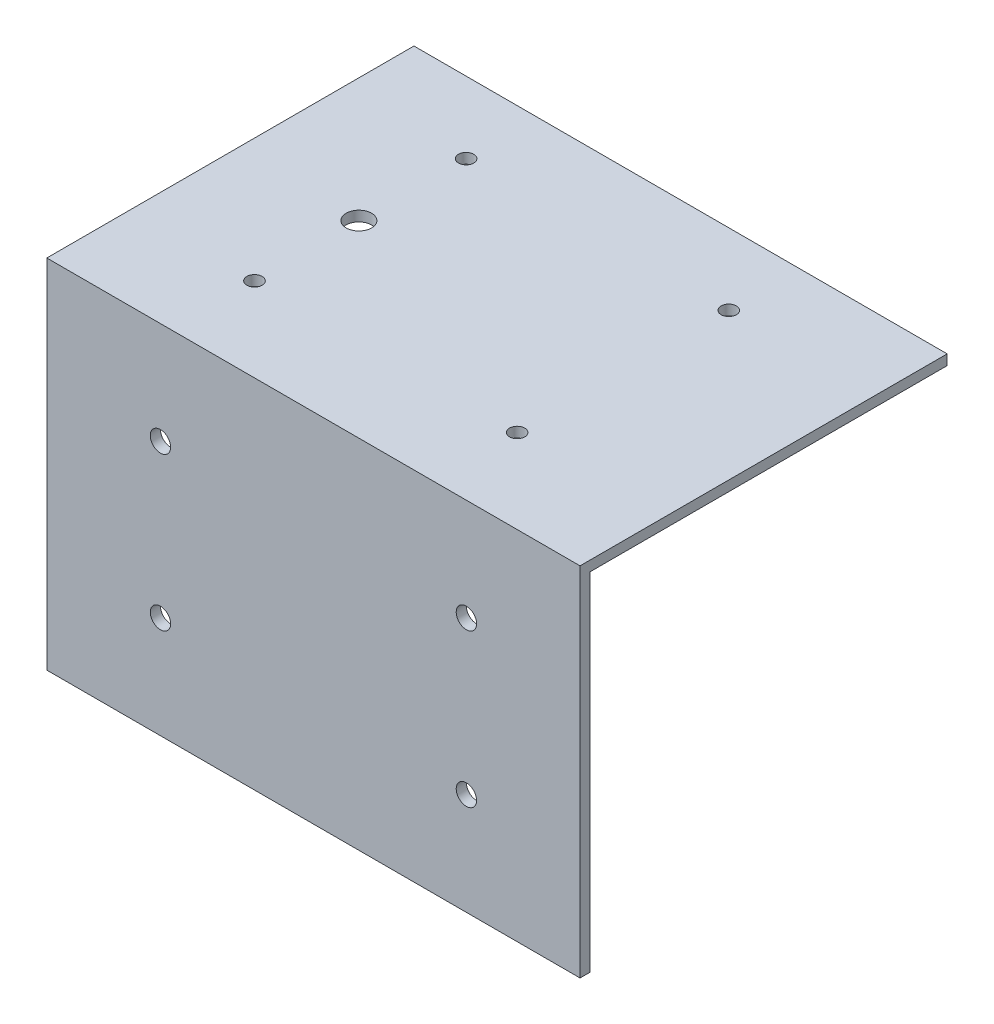
ISO-10303-21;
HEADER;
FILE_DESCRIPTION(('STEP AP214'),'2;1');
FILE_NAME('part.step','',(''),(''),'','','');
FILE_SCHEMA(('AUTOMOTIVE_DESIGN { 1 0 10303 214 1 1 1 1 }'));
ENDSEC;
DATA;
#1=APPLICATION_CONTEXT('core data for automotive mechanical design processes');
#2=APPLICATION_PROTOCOL_DEFINITION('international standard','automotive_design',2000,#1);
#3=PRODUCT_CONTEXT('',#1,'mechanical');
#4=PRODUCT('Part','Part','',(#3));
#5=PRODUCT_RELATED_PRODUCT_CATEGORY('part','',(#4));
#6=PRODUCT_DEFINITION_FORMATION('','',#4);
#7=PRODUCT_DEFINITION_CONTEXT('part definition',#1,'design');
#8=PRODUCT_DEFINITION('design','',#6,#7);
#9=PRODUCT_DEFINITION_SHAPE('','',#8);
#10=(LENGTH_UNIT() NAMED_UNIT(*) SI_UNIT(.MILLI.,.METRE.));
#11=(NAMED_UNIT(*) PLANE_ANGLE_UNIT() SI_UNIT($,.RADIAN.));
#12=(NAMED_UNIT(*) SI_UNIT($,.STERADIAN.) SOLID_ANGLE_UNIT());
#13=UNCERTAINTY_MEASURE_WITH_UNIT(LENGTH_MEASURE(1.E-05),#10,'distance_accuracy_value','');
#14=(GEOMETRIC_REPRESENTATION_CONTEXT(3) GLOBAL_UNCERTAINTY_ASSIGNED_CONTEXT((#13)) GLOBAL_UNIT_ASSIGNED_CONTEXT((#10,
#11,#12)) REPRESENTATION_CONTEXT('',''));
#15=CARTESIAN_POINT('',(0.,0.,0.));
#16=DIRECTION('',(0.,0.,1.));
#17=DIRECTION('',(1.,0.,0.));
#18=AXIS2_PLACEMENT_3D('',#15,#16,#17);
#19=CARTESIAN_POINT('',(0.,2.,0.));
#20=DIRECTION('',(0.,-1.,0.));
#21=DIRECTION('',(0.,0.,-1.));
#22=AXIS2_PLACEMENT_3D('',#19,#20,#21);
#23=PLANE('',#22);
#24=DIRECTION('',(1.,0.,0.));
#25=VECTOR('',#24,1.);
#26=CARTESIAN_POINT('',(-50.,2.,37.));
#27=LINE('',#26,#25);
#28=CARTESIAN_POINT('',(-50.,2.,37.));
#29=VERTEX_POINT('',#28);
#30=CARTESIAN_POINT('',(54.57,2.,37.));
#31=VERTEX_POINT('',#30);
#32=EDGE_CURVE('E89',#29,#31,#27,.T.);
#33=ORIENTED_EDGE('',*,*,#32,.T.);
#34=DIRECTION('',(0.,0.,1.));
#35=VECTOR('',#34,1.);
#36=CARTESIAN_POINT('',(54.57,2.,-35.));
#37=LINE('',#36,#35);
#38=CARTESIAN_POINT('',(54.57,2.,-35.));
#39=VERTEX_POINT('',#38);
#40=EDGE_CURVE('E92',#39,#31,#37,.T.);
#41=ORIENTED_EDGE('',*,*,#40,.F.);
#42=DIRECTION('',(-1.,0.,0.));
#43=VECTOR('',#42,1.);
#44=CARTESIAN_POINT('',(-50.,2.,-35.));
#45=LINE('',#44,#43);
#46=CARTESIAN_POINT('',(-50.,2.,-35.));
#47=VERTEX_POINT('',#46);
#48=EDGE_CURVE('E50',#39,#47,#45,.T.);
#49=ORIENTED_EDGE('',*,*,#48,.T.);
#50=DIRECTION('',(0.,0.,1.));
#51=VECTOR('',#50,1.);
#52=CARTESIAN_POINT('',(-50.,2.,35.));
#53=LINE('',#52,#51);
#54=EDGE_CURVE('E42',#47,#29,#53,.T.);
#55=ORIENTED_EDGE('',*,*,#54,.T.);
#56=EDGE_LOOP('',(#33,#41,#49,#55));
#57=FACE_BOUND('',#56,.T.);
#58=CARTESIAN_POINT('',(25.755,2.,-20.98));
#59=DIRECTION('',(0.,1.,0.));
#60=DIRECTION('',(0.,0.,1.));
#61=AXIS2_PLACEMENT_3D('',#58,#59,#60);
#62=CIRCLE('',#61,1.5);
#63=CARTESIAN_POINT('',(25.755,2.,-19.48));
#64=VERTEX_POINT('',#63);
#65=EDGE_CURVE('E157',#64,#64,#62,.T.);
#66=ORIENTED_EDGE('',*,*,#65,.F.);
#67=EDGE_LOOP('',(#66));
#68=FACE_BOUND('',#67,.T.);
#69=CARTESIAN_POINT('',(-25.755,2.,-20.98));
#70=DIRECTION('',(0.,1.,0.));
#71=DIRECTION('',(0.,0.,1.));
#72=AXIS2_PLACEMENT_3D('',#69,#70,#71);
#73=CIRCLE('',#72,1.5);
#74=CARTESIAN_POINT('',(-25.755,2.,-19.48));
#75=VERTEX_POINT('',#74);
#76=EDGE_CURVE('E151',#75,#75,#73,.T.);
#77=ORIENTED_EDGE('',*,*,#76,.F.);
#78=EDGE_LOOP('',(#77));
#79=FACE_BOUND('',#78,.T.);
#80=CARTESIAN_POINT('',(25.755,2.,20.52));
#81=DIRECTION('',(0.,1.,0.));
#82=DIRECTION('',(0.,0.,1.));
#83=AXIS2_PLACEMENT_3D('',#80,#81,#82);
#84=CIRCLE('',#83,1.5);
#85=CARTESIAN_POINT('',(25.755,2.,22.02));
#86=VERTEX_POINT('',#85);
#87=EDGE_CURVE('E145',#86,#86,#84,.T.);
#88=ORIENTED_EDGE('',*,*,#87,.F.);
#89=EDGE_LOOP('',(#88));
#90=FACE_BOUND('',#89,.T.);
#91=CARTESIAN_POINT('',(-25.755,2.,20.52));
#92=DIRECTION('',(0.,1.,0.));
#93=DIRECTION('',(0.,0.,1.));
#94=AXIS2_PLACEMENT_3D('',#91,#92,#93);
#95=CIRCLE('',#94,1.5);
#96=CARTESIAN_POINT('',(-25.755,2.,22.02));
#97=VERTEX_POINT('',#96);
#98=EDGE_CURVE('E139',#97,#97,#95,.T.);
#99=ORIENTED_EDGE('',*,*,#98,.F.);
#100=EDGE_LOOP('',(#99));
#101=FACE_BOUND('',#100,.T.);
#102=CARTESIAN_POINT('',(-25.755,2.,0.0499999999999806));
#103=DIRECTION('',(0.,1.,0.));
#104=DIRECTION('',(0.,0.,1.));
#105=AXIS2_PLACEMENT_3D('',#102,#103,#104);
#106=CIRCLE('',#105,2.5);
#107=CARTESIAN_POINT('',(-25.755,2.,2.54999999999998));
#108=VERTEX_POINT('',#107);
#109=EDGE_CURVE('E133',#108,#108,#106,.T.);
#110=ORIENTED_EDGE('',*,*,#109,.F.);
#111=EDGE_LOOP('',(#110));
#112=FACE_BOUND('',#111,.T.);
#113=ADVANCED_FACE('F32',(#57,#68,#79,#90,#101,#112),#23,.F.);
#114=CARTESIAN_POINT('',(0.,0.,0.));
#115=DIRECTION('',(0.,-1.,0.));
#116=DIRECTION('',(0.,0.,-1.));
#117=AXIS2_PLACEMENT_3D('',#114,#115,#116);
#118=PLANE('',#117);
#119=CARTESIAN_POINT('',(-25.755,0.,20.52));
#120=DIRECTION('',(0.,1.,0.));
#121=DIRECTION('',(0.,0.,1.));
#122=AXIS2_PLACEMENT_3D('',#119,#120,#121);
#123=CIRCLE('',#122,1.5);
#124=CARTESIAN_POINT('',(-25.755,0.,22.02));
#125=VERTEX_POINT('',#124);
#126=EDGE_CURVE('E136',#125,#125,#123,.T.);
#127=ORIENTED_EDGE('',*,*,#126,.T.);
#128=EDGE_LOOP('',(#127));
#129=FACE_BOUND('',#128,.T.);
#130=CARTESIAN_POINT('',(-25.755,0.,-20.98));
#131=DIRECTION('',(0.,1.,0.));
#132=DIRECTION('',(0.,0.,1.));
#133=AXIS2_PLACEMENT_3D('',#130,#131,#132);
#134=CIRCLE('',#133,1.5);
#135=CARTESIAN_POINT('',(-25.755,0.,-19.48));
#136=VERTEX_POINT('',#135);
#137=EDGE_CURVE('E148',#136,#136,#134,.T.);
#138=ORIENTED_EDGE('',*,*,#137,.T.);
#139=EDGE_LOOP('',(#138));
#140=FACE_BOUND('',#139,.T.);
#141=DIRECTION('',(-1.,0.,0.));
#142=VECTOR('',#141,1.);
#143=CARTESIAN_POINT('',(-50.,0.,-35.));
#144=LINE('',#143,#142);
#145=CARTESIAN_POINT('',(54.57,0.,-35.));
#146=VERTEX_POINT('',#145);
#147=CARTESIAN_POINT('',(-50.,0.,-35.));
#148=VERTEX_POINT('',#147);
#149=EDGE_CURVE('E62',#146,#148,#144,.T.);
#150=ORIENTED_EDGE('',*,*,#149,.F.);
#151=DIRECTION('',(0.,0.,-1.));
#152=VECTOR('',#151,1.);
#153=CARTESIAN_POINT('',(54.57,0.,-35.));
#154=LINE('',#153,#152);
#155=CARTESIAN_POINT('',(54.57,0.,35.));
#156=VERTEX_POINT('',#155);
#157=EDGE_CURVE('E99',#156,#146,#154,.T.);
#158=ORIENTED_EDGE('',*,*,#157,.F.);
#159=DIRECTION('',(1.,0.,0.));
#160=VECTOR('',#159,1.);
#161=CARTESIAN_POINT('',(-50.,0.,35.));
#162=LINE('',#161,#160);
#163=CARTESIAN_POINT('',(-50.,0.,35.));
#164=VERTEX_POINT('',#163);
#165=EDGE_CURVE('E163',#164,#156,#162,.T.);
#166=ORIENTED_EDGE('',*,*,#165,.F.);
#167=DIRECTION('',(0.,0.,1.));
#168=VECTOR('',#167,1.);
#169=CARTESIAN_POINT('',(-50.,0.,35.));
#170=LINE('',#169,#168);
#171=EDGE_CURVE('E166',#148,#164,#170,.T.);
#172=ORIENTED_EDGE('',*,*,#171,.F.);
#173=EDGE_LOOP('',(#150,#158,#166,#172));
#174=FACE_BOUND('',#173,.T.);
#175=CARTESIAN_POINT('',(25.755,0.,-20.98));
#176=DIRECTION('',(0.,1.,0.));
#177=DIRECTION('',(0.,0.,1.));
#178=AXIS2_PLACEMENT_3D('',#175,#176,#177);
#179=CIRCLE('',#178,1.5);
#180=CARTESIAN_POINT('',(25.755,0.,-19.48));
#181=VERTEX_POINT('',#180);
#182=EDGE_CURVE('E154',#181,#181,#179,.T.);
#183=ORIENTED_EDGE('',*,*,#182,.T.);
#184=EDGE_LOOP('',(#183));
#185=FACE_BOUND('',#184,.T.);
#186=CARTESIAN_POINT('',(25.755,0.,20.52));
#187=DIRECTION('',(0.,1.,0.));
#188=DIRECTION('',(0.,0.,1.));
#189=AXIS2_PLACEMENT_3D('',#186,#187,#188);
#190=CIRCLE('',#189,1.5);
#191=CARTESIAN_POINT('',(25.755,0.,22.02));
#192=VERTEX_POINT('',#191);
#193=EDGE_CURVE('E142',#192,#192,#190,.T.);
#194=ORIENTED_EDGE('',*,*,#193,.T.);
#195=EDGE_LOOP('',(#194));
#196=FACE_BOUND('',#195,.T.);
#197=CARTESIAN_POINT('',(-25.755,0.,0.0499999999999806));
#198=DIRECTION('',(0.,1.,0.));
#199=DIRECTION('',(0.,0.,1.));
#200=AXIS2_PLACEMENT_3D('',#197,#198,#199);
#201=CIRCLE('',#200,2.5);
#202=CARTESIAN_POINT('',(-25.755,0.,2.54999999999998));
#203=VERTEX_POINT('',#202);
#204=EDGE_CURVE('E131',#203,#203,#201,.T.);
#205=ORIENTED_EDGE('',*,*,#204,.T.);
#206=EDGE_LOOP('',(#205));
#207=FACE_BOUND('',#206,.T.);
#208=ADVANCED_FACE('F214',(#129,#140,#174,#185,#196,#207),#118,.T.);
#209=CARTESIAN_POINT('',(-50.,2.,-35.));
#210=DIRECTION('',(0.,0.,1.));
#211=DIRECTION('',(1.,0.,0.));
#212=AXIS2_PLACEMENT_3D('',#209,#210,#211);
#213=PLANE('',#212);
#214=ORIENTED_EDGE('',*,*,#149,.T.);
#215=DIRECTION('',(0.,-1.,0.));
#216=VECTOR('',#215,1.);
#217=CARTESIAN_POINT('',(-50.,2.,-35.));
#218=LINE('',#217,#216);
#219=EDGE_CURVE('E11',#47,#148,#218,.T.);
#220=ORIENTED_EDGE('',*,*,#219,.F.);
#221=ORIENTED_EDGE('',*,*,#48,.F.);
#222=DIRECTION('',(0.,1.,0.));
#223=VECTOR('',#222,1.);
#224=CARTESIAN_POINT('',(54.57,2.,-35.));
#225=LINE('',#224,#223);
#226=EDGE_CURVE('E107',#146,#39,#225,.T.);
#227=ORIENTED_EDGE('',*,*,#226,.F.);
#228=EDGE_LOOP('',(#214,#220,#221,#227));
#229=FACE_BOUND('',#228,.T.);
#230=ADVANCED_FACE('F34',(#229),#213,.F.);
#231=CARTESIAN_POINT('',(-50.,2.,35.));
#232=DIRECTION('',(1.,0.,0.));
#233=DIRECTION('',(0.,0.,-1.));
#234=AXIS2_PLACEMENT_3D('',#231,#232,#233);
#235=PLANE('',#234);
#236=ORIENTED_EDGE('',*,*,#171,.T.);
#237=DIRECTION('',(0.,1.,0.));
#238=VECTOR('',#237,1.);
#239=CARTESIAN_POINT('',(-50.,-68.,35.));
#240=LINE('',#239,#238);
#241=CARTESIAN_POINT('',(-50.,-68.,35.));
#242=VERTEX_POINT('',#241);
#243=EDGE_CURVE('E68',#242,#164,#240,.T.);
#244=ORIENTED_EDGE('',*,*,#243,.F.);
#245=DIRECTION('',(0.,0.,1.));
#246=VECTOR('',#245,1.);
#247=CARTESIAN_POINT('',(-50.,-68.,35.));
#248=LINE('',#247,#246);
#249=CARTESIAN_POINT('',(-50.,-68.,37.));
#250=VERTEX_POINT('',#249);
#251=EDGE_CURVE('E98',#242,#250,#248,.T.);
#252=ORIENTED_EDGE('',*,*,#251,.T.);
#253=DIRECTION('',(0.,1.,0.));
#254=VECTOR('',#253,1.);
#255=CARTESIAN_POINT('',(-50.,-68.,37.));
#256=LINE('',#255,#254);
#257=EDGE_CURVE('E128',#250,#29,#256,.T.);
#258=ORIENTED_EDGE('',*,*,#257,.T.);
#259=ORIENTED_EDGE('',*,*,#54,.F.);
#260=ORIENTED_EDGE('',*,*,#219,.T.);
#261=EDGE_LOOP('',(#236,#244,#252,#258,#259,#260));
#262=FACE_BOUND('',#261,.T.);
#263=ADVANCED_FACE('F216',(#262),#235,.F.);
#264=CARTESIAN_POINT('',(25.755,2.,-20.98));
#265=DIRECTION('',(0.,-1.,0.));
#266=DIRECTION('',(0.,0.,-1.));
#267=AXIS2_PLACEMENT_3D('',#264,#265,#266);
#268=CYLINDRICAL_SURFACE('',#267,1.5);
#269=ORIENTED_EDGE('',*,*,#65,.T.);
#270=EDGE_LOOP('',(#269));
#271=FACE_BOUND('',#270,.T.);
#272=ORIENTED_EDGE('',*,*,#182,.F.);
#273=EDGE_LOOP('',(#272));
#274=FACE_BOUND('',#273,.T.);
#275=ADVANCED_FACE('F218',(#271,#274),#268,.F.);
#276=CARTESIAN_POINT('',(-25.755,2.,-20.98));
#277=DIRECTION('',(0.,-1.,0.));
#278=DIRECTION('',(0.,0.,-1.));
#279=AXIS2_PLACEMENT_3D('',#276,#277,#278);
#280=CYLINDRICAL_SURFACE('',#279,1.5);
#281=ORIENTED_EDGE('',*,*,#76,.T.);
#282=EDGE_LOOP('',(#281));
#283=FACE_BOUND('',#282,.T.);
#284=ORIENTED_EDGE('',*,*,#137,.F.);
#285=EDGE_LOOP('',(#284));
#286=FACE_BOUND('',#285,.T.);
#287=ADVANCED_FACE('F223',(#283,#286),#280,.F.);
#288=CARTESIAN_POINT('',(25.755,2.,20.52));
#289=DIRECTION('',(0.,-1.,0.));
#290=DIRECTION('',(0.,0.,-1.));
#291=AXIS2_PLACEMENT_3D('',#288,#289,#290);
#292=CYLINDRICAL_SURFACE('',#291,1.5);
#293=ORIENTED_EDGE('',*,*,#87,.T.);
#294=EDGE_LOOP('',(#293));
#295=FACE_BOUND('',#294,.T.);
#296=ORIENTED_EDGE('',*,*,#193,.F.);
#297=EDGE_LOOP('',(#296));
#298=FACE_BOUND('',#297,.T.);
#299=ADVANCED_FACE('F236',(#295,#298),#292,.F.);
#300=CARTESIAN_POINT('',(-25.755,2.,20.52));
#301=DIRECTION('',(0.,-1.,0.));
#302=DIRECTION('',(0.,0.,-1.));
#303=AXIS2_PLACEMENT_3D('',#300,#301,#302);
#304=CYLINDRICAL_SURFACE('',#303,1.5);
#305=ORIENTED_EDGE('',*,*,#98,.T.);
#306=EDGE_LOOP('',(#305));
#307=FACE_BOUND('',#306,.T.);
#308=ORIENTED_EDGE('',*,*,#126,.F.);
#309=EDGE_LOOP('',(#308));
#310=FACE_BOUND('',#309,.T.);
#311=ADVANCED_FACE('F240',(#307,#310),#304,.F.);
#312=CARTESIAN_POINT('',(-25.755,2.,0.0499999999999806));
#313=DIRECTION('',(0.,-1.,0.));
#314=DIRECTION('',(0.,0.,-1.));
#315=AXIS2_PLACEMENT_3D('',#312,#313,#314);
#316=CYLINDRICAL_SURFACE('',#315,2.5);
#317=ORIENTED_EDGE('',*,*,#109,.T.);
#318=EDGE_LOOP('',(#317));
#319=FACE_BOUND('',#318,.T.);
#320=ORIENTED_EDGE('',*,*,#204,.F.);
#321=EDGE_LOOP('',(#320));
#322=FACE_BOUND('',#321,.T.);
#323=ADVANCED_FACE('F244',(#319,#322),#316,.F.);
#324=CARTESIAN_POINT('',(-50.,-68.,35.));
#325=DIRECTION('',(0.,0.,-1.));
#326=DIRECTION('',(-1.,0.,0.));
#327=AXIS2_PLACEMENT_3D('',#324,#325,#326);
#328=PLANE('',#327);
#329=CARTESIAN_POINT('',(32.285,-48.,35.));
#330=DIRECTION('',(0.,0.,-1.));
#331=DIRECTION('',(-1.,0.,0.));
#332=AXIS2_PLACEMENT_3D('',#329,#330,#331);
#333=CIRCLE('',#332,2.);
#334=CARTESIAN_POINT('',(30.285,-48.,35.));
#335=VERTEX_POINT('',#334);
#336=EDGE_CURVE('E205',#335,#335,#333,.T.);
#337=ORIENTED_EDGE('',*,*,#336,.F.);
#338=EDGE_LOOP('',(#337));
#339=FACE_BOUND('',#338,.T.);
#340=CARTESIAN_POINT('',(-27.715,-48.,35.));
#341=DIRECTION('',(0.,0.,-1.));
#342=DIRECTION('',(-1.,0.,0.));
#343=AXIS2_PLACEMENT_3D('',#340,#341,#342);
#344=CIRCLE('',#343,2.);
#345=CARTESIAN_POINT('',(-29.715,-48.,35.));
#346=VERTEX_POINT('',#345);
#347=EDGE_CURVE('E202',#346,#346,#344,.T.);
#348=ORIENTED_EDGE('',*,*,#347,.F.);
#349=EDGE_LOOP('',(#348));
#350=FACE_BOUND('',#349,.T.);
#351=CARTESIAN_POINT('',(-27.715,-18.,35.));
#352=DIRECTION('',(0.,0.,-1.));
#353=DIRECTION('',(-1.,0.,0.));
#354=AXIS2_PLACEMENT_3D('',#351,#352,#353);
#355=CIRCLE('',#354,2.);
#356=CARTESIAN_POINT('',(-29.715,-18.,35.));
#357=VERTEX_POINT('',#356);
#358=EDGE_CURVE('E199',#357,#357,#355,.T.);
#359=ORIENTED_EDGE('',*,*,#358,.F.);
#360=EDGE_LOOP('',(#359));
#361=FACE_BOUND('',#360,.T.);
#362=CARTESIAN_POINT('',(32.285,-18.,35.));
#363=DIRECTION('',(0.,0.,-1.));
#364=DIRECTION('',(-1.,0.,0.));
#365=AXIS2_PLACEMENT_3D('',#362,#363,#364);
#366=CIRCLE('',#365,2.);
#367=CARTESIAN_POINT('',(30.285,-18.,35.));
#368=VERTEX_POINT('',#367);
#369=EDGE_CURVE('E173',#368,#368,#366,.T.);
#370=ORIENTED_EDGE('',*,*,#369,.F.);
#371=EDGE_LOOP('',(#370));
#372=FACE_BOUND('',#371,.T.);
#373=ORIENTED_EDGE('',*,*,#243,.T.);
#374=ORIENTED_EDGE('',*,*,#165,.T.);
#375=DIRECTION('',(0.,1.,0.));
#376=VECTOR('',#375,1.);
#377=CARTESIAN_POINT('',(54.57,-102.62780530152,35.));
#378=LINE('',#377,#376);
#379=CARTESIAN_POINT('',(54.57,-68.,35.));
#380=VERTEX_POINT('',#379);
#381=EDGE_CURVE('E113',#380,#156,#378,.T.);
#382=ORIENTED_EDGE('',*,*,#381,.F.);
#383=DIRECTION('',(-1.,0.,0.));
#384=VECTOR('',#383,1.);
#385=CARTESIAN_POINT('',(-50.,-68.,35.));
#386=LINE('',#385,#384);
#387=EDGE_CURVE('E126',#380,#242,#386,.T.);
#388=ORIENTED_EDGE('',*,*,#387,.T.);
#389=EDGE_LOOP('',(#373,#374,#382,#388));
#390=FACE_BOUND('',#389,.T.);
#391=ADVANCED_FACE('F184',(#339,#350,#361,#372,#390),#328,.T.);
#392=CARTESIAN_POINT('',(-50.,-68.,37.));
#393=DIRECTION('',(0.,0.,1.));
#394=DIRECTION('',(1.,0.,0.));
#395=AXIS2_PLACEMENT_3D('',#392,#393,#394);
#396=PLANE('',#395);
#397=CARTESIAN_POINT('',(32.285,-48.,37.));
#398=DIRECTION('',(0.,0.,1.));
#399=DIRECTION('',(1.,0.,0.));
#400=AXIS2_PLACEMENT_3D('',#397,#398,#399);
#401=CIRCLE('',#400,2.);
#402=CARTESIAN_POINT('',(34.285,-48.,37.));
#403=VERTEX_POINT('',#402);
#404=EDGE_CURVE('E36',#403,#403,#401,.T.);
#405=ORIENTED_EDGE('',*,*,#404,.F.);
#406=EDGE_LOOP('',(#405));
#407=FACE_BOUND('',#406,.T.);
#408=CARTESIAN_POINT('',(-27.715,-48.,37.));
#409=DIRECTION('',(0.,0.,1.));
#410=DIRECTION('',(1.,0.,0.));
#411=AXIS2_PLACEMENT_3D('',#408,#409,#410);
#412=CIRCLE('',#411,2.);
#413=CARTESIAN_POINT('',(-25.715,-48.,37.));
#414=VERTEX_POINT('',#413);
#415=EDGE_CURVE('E119',#414,#414,#412,.T.);
#416=ORIENTED_EDGE('',*,*,#415,.F.);
#417=EDGE_LOOP('',(#416));
#418=FACE_BOUND('',#417,.T.);
#419=CARTESIAN_POINT('',(-27.715,-18.,37.));
#420=DIRECTION('',(0.,0.,1.));
#421=DIRECTION('',(1.,0.,0.));
#422=AXIS2_PLACEMENT_3D('',#419,#420,#421);
#423=CIRCLE('',#422,2.);
#424=CARTESIAN_POINT('',(-25.715,-18.,37.));
#425=VERTEX_POINT('',#424);
#426=EDGE_CURVE('E172',#425,#425,#423,.T.);
#427=ORIENTED_EDGE('',*,*,#426,.F.);
#428=EDGE_LOOP('',(#427));
#429=FACE_BOUND('',#428,.T.);
#430=CARTESIAN_POINT('',(32.285,-18.,37.));
#431=DIRECTION('',(0.,0.,1.));
#432=DIRECTION('',(1.,0.,0.));
#433=AXIS2_PLACEMENT_3D('',#430,#431,#432);
#434=CIRCLE('',#433,2.);
#435=CARTESIAN_POINT('',(34.285,-18.,37.));
#436=VERTEX_POINT('',#435);
#437=EDGE_CURVE('E169',#436,#436,#434,.T.);
#438=ORIENTED_EDGE('',*,*,#437,.F.);
#439=EDGE_LOOP('',(#438));
#440=FACE_BOUND('',#439,.T.);
#441=ORIENTED_EDGE('',*,*,#32,.F.);
#442=ORIENTED_EDGE('',*,*,#257,.F.);
#443=DIRECTION('',(1.,0.,0.));
#444=VECTOR('',#443,1.);
#445=CARTESIAN_POINT('',(-50.,-68.,37.));
#446=LINE('',#445,#444);
#447=CARTESIAN_POINT('',(54.57,-68.,37.));
#448=VERTEX_POINT('',#447);
#449=EDGE_CURVE('E111',#250,#448,#446,.T.);
#450=ORIENTED_EDGE('',*,*,#449,.T.);
#451=DIRECTION('',(0.,1.,0.));
#452=VECTOR('',#451,1.);
#453=CARTESIAN_POINT('',(54.57,-102.62780530152,37.));
#454=LINE('',#453,#452);
#455=EDGE_CURVE('E105',#448,#31,#454,.T.);
#456=ORIENTED_EDGE('',*,*,#455,.T.);
#457=EDGE_LOOP('',(#441,#442,#450,#456));
#458=FACE_BOUND('',#457,.T.);
#459=ADVANCED_FACE('F109',(#407,#418,#429,#440,#458),#396,.T.);
#460=CARTESIAN_POINT('',(0.,-68.,0.));
#461=DIRECTION('',(0.,1.,0.));
#462=DIRECTION('',(0.,0.,1.));
#463=AXIS2_PLACEMENT_3D('',#460,#461,#462);
#464=PLANE('',#463);
#465=ORIENTED_EDGE('',*,*,#251,.F.);
#466=ORIENTED_EDGE('',*,*,#387,.F.);
#467=DIRECTION('',(0.,0.,1.));
#468=VECTOR('',#467,1.);
#469=CARTESIAN_POINT('',(54.57,-68.,35.));
#470=LINE('',#469,#468);
#471=EDGE_CURVE('E116',#380,#448,#470,.T.);
#472=ORIENTED_EDGE('',*,*,#471,.T.);
#473=ORIENTED_EDGE('',*,*,#449,.F.);
#474=EDGE_LOOP('',(#465,#466,#472,#473));
#475=FACE_BOUND('',#474,.T.);
#476=ADVANCED_FACE('F183',(#475),#464,.F.);
#477=CARTESIAN_POINT('',(54.57,0.,0.));
#478=DIRECTION('',(-1.,0.,0.));
#479=DIRECTION('',(0.,0.,1.));
#480=AXIS2_PLACEMENT_3D('',#477,#478,#479);
#481=PLANE('',#480);
#482=ORIENTED_EDGE('',*,*,#226,.T.);
#483=ORIENTED_EDGE('',*,*,#40,.T.);
#484=ORIENTED_EDGE('',*,*,#455,.F.);
#485=ORIENTED_EDGE('',*,*,#471,.F.);
#486=ORIENTED_EDGE('',*,*,#381,.T.);
#487=ORIENTED_EDGE('',*,*,#157,.T.);
#488=EDGE_LOOP('',(#482,#483,#484,#485,#486,#487));
#489=FACE_BOUND('',#488,.T.);
#490=ADVANCED_FACE('F103',(#489),#481,.F.);
#491=CARTESIAN_POINT('',(32.285,-18.,45.));
#492=DIRECTION('',(0.,0.,-1.));
#493=DIRECTION('',(-1.,0.,0.));
#494=AXIS2_PLACEMENT_3D('',#491,#492,#493);
#495=CYLINDRICAL_SURFACE('',#494,2.);
#496=ORIENTED_EDGE('',*,*,#437,.T.);
#497=EDGE_LOOP('',(#496));
#498=FACE_BOUND('',#497,.T.);
#499=ORIENTED_EDGE('',*,*,#369,.T.);
#500=EDGE_LOOP('',(#499));
#501=FACE_BOUND('',#500,.T.);
#502=ADVANCED_FACE('F191',(#498,#501),#495,.F.);
#503=CARTESIAN_POINT('',(-27.715,-18.,45.));
#504=DIRECTION('',(0.,0.,-1.));
#505=DIRECTION('',(-1.,0.,0.));
#506=AXIS2_PLACEMENT_3D('',#503,#504,#505);
#507=CYLINDRICAL_SURFACE('',#506,2.);
#508=ORIENTED_EDGE('',*,*,#426,.T.);
#509=EDGE_LOOP('',(#508));
#510=FACE_BOUND('',#509,.T.);
#511=ORIENTED_EDGE('',*,*,#358,.T.);
#512=EDGE_LOOP('',(#511));
#513=FACE_BOUND('',#512,.T.);
#514=ADVANCED_FACE('F194',(#510,#513),#507,.F.);
#515=CARTESIAN_POINT('',(-27.715,-48.,45.));
#516=DIRECTION('',(0.,0.,-1.));
#517=DIRECTION('',(-1.,0.,0.));
#518=AXIS2_PLACEMENT_3D('',#515,#516,#517);
#519=CYLINDRICAL_SURFACE('',#518,2.);
#520=ORIENTED_EDGE('',*,*,#415,.T.);
#521=EDGE_LOOP('',(#520));
#522=FACE_BOUND('',#521,.T.);
#523=ORIENTED_EDGE('',*,*,#347,.T.);
#524=EDGE_LOOP('',(#523));
#525=FACE_BOUND('',#524,.T.);
#526=ADVANCED_FACE('F178',(#522,#525),#519,.F.);
#527=CARTESIAN_POINT('',(32.285,-48.,45.));
#528=DIRECTION('',(0.,0.,-1.));
#529=DIRECTION('',(-1.,0.,0.));
#530=AXIS2_PLACEMENT_3D('',#527,#528,#529);
#531=CYLINDRICAL_SURFACE('',#530,2.);
#532=ORIENTED_EDGE('',*,*,#404,.T.);
#533=EDGE_LOOP('',(#532));
#534=FACE_BOUND('',#533,.T.);
#535=ORIENTED_EDGE('',*,*,#336,.T.);
#536=EDGE_LOOP('',(#535));
#537=FACE_BOUND('',#536,.T.);
#538=ADVANCED_FACE('F256',(#534,#537),#531,.F.);
#539=CLOSED_SHELL('',(#113,#208,#230,#263,#275,#287,#299,#311,#323,#391,#459,#476,#490,#502,
#514,#526,#538));
#540=MANIFOLD_SOLID_BREP('B2',#539);
#541=ADVANCED_BREP_SHAPE_REPRESENTATION('',(#18,#540),#14);
#542=SHAPE_DEFINITION_REPRESENTATION(#9,#541);
ENDSEC;
END-ISO-10303-21;
